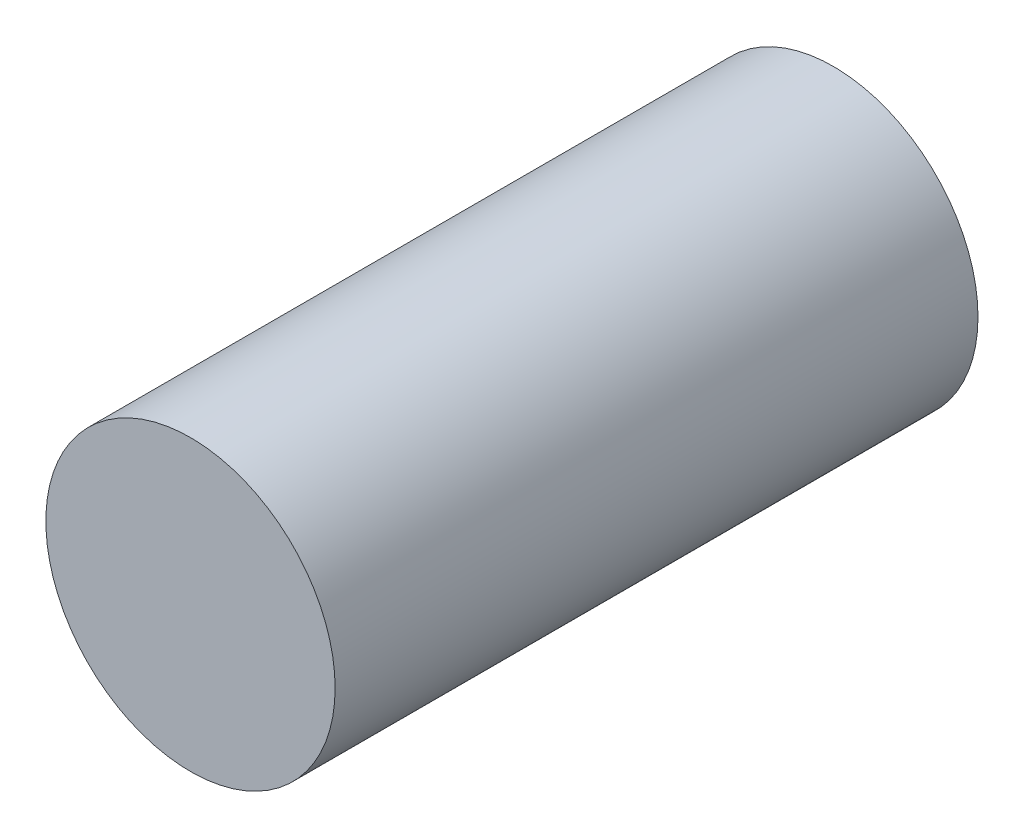
ISO-10303-21;
HEADER;
FILE_DESCRIPTION(('STEP AP214'),'2;1');
FILE_NAME('part.step','',(''),(''),'','','');
FILE_SCHEMA(('AUTOMOTIVE_DESIGN { 1 0 10303 214 1 1 1 1 }'));
ENDSEC;
DATA;
#1=APPLICATION_CONTEXT('core data for automotive mechanical design processes');
#2=APPLICATION_PROTOCOL_DEFINITION('international standard','automotive_design',2000,#1);
#3=PRODUCT_CONTEXT('',#1,'mechanical');
#4=PRODUCT('Part','Part','',(#3));
#5=PRODUCT_RELATED_PRODUCT_CATEGORY('part','',(#4));
#6=PRODUCT_DEFINITION_FORMATION('','',#4);
#7=PRODUCT_DEFINITION_CONTEXT('part definition',#1,'design');
#8=PRODUCT_DEFINITION('design','',#6,#7);
#9=PRODUCT_DEFINITION_SHAPE('','',#8);
#10=(LENGTH_UNIT() NAMED_UNIT(*) SI_UNIT(.MILLI.,.METRE.));
#11=(NAMED_UNIT(*) PLANE_ANGLE_UNIT() SI_UNIT($,.RADIAN.));
#12=(NAMED_UNIT(*) SI_UNIT($,.STERADIAN.) SOLID_ANGLE_UNIT());
#13=UNCERTAINTY_MEASURE_WITH_UNIT(LENGTH_MEASURE(1.E-05),#10,'distance_accuracy_value','');
#14=(GEOMETRIC_REPRESENTATION_CONTEXT(3) GLOBAL_UNCERTAINTY_ASSIGNED_CONTEXT((#13)) GLOBAL_UNIT_ASSIGNED_CONTEXT((#10,
#11,#12)) REPRESENTATION_CONTEXT('',''));
#15=CARTESIAN_POINT('',(0.,0.,0.));
#16=DIRECTION('',(0.,0.,1.));
#17=DIRECTION('',(1.,0.,0.));
#18=AXIS2_PLACEMENT_3D('',#15,#16,#17);
#19=CARTESIAN_POINT('',(0.,43.13837706885,-6.));
#20=DIRECTION('',(0.,0.,1.));
#21=DIRECTION('',(1.,0.,0.));
#22=AXIS2_PLACEMENT_3D('',#19,#20,#21);
#23=CYLINDRICAL_SURFACE('',#22,4.5);
#24=CARTESIAN_POINT('',(0.,43.13837706885,-6.));
#25=DIRECTION('',(0.,0.,1.));
#26=DIRECTION('',(1.,0.,0.));
#27=AXIS2_PLACEMENT_3D('',#24,#25,#26);
#28=CIRCLE('',#27,4.5);
#29=CARTESIAN_POINT('',(4.49999999999996,43.13837706885,-6.));
#30=VERTEX_POINT('',#29);
#31=EDGE_CURVE('E10',#30,#30,#28,.T.);
#32=ORIENTED_EDGE('',*,*,#31,.T.);
#33=EDGE_LOOP('',(#32));
#34=FACE_BOUND('',#33,.T.);
#35=CARTESIAN_POINT('',(0.,43.13837706885,14.));
#36=DIRECTION('',(0.,0.,1.));
#37=DIRECTION('',(1.,0.,0.));
#38=AXIS2_PLACEMENT_3D('',#35,#36,#37);
#39=CIRCLE('',#38,4.5);
#40=CARTESIAN_POINT('',(4.49999999999996,43.13837706885,14.));
#41=VERTEX_POINT('',#40);
#42=EDGE_CURVE('E41',#41,#41,#39,.T.);
#43=ORIENTED_EDGE('',*,*,#42,.F.);
#44=EDGE_LOOP('',(#43));
#45=FACE_BOUND('',#44,.T.);
#46=ADVANCED_FACE('F35',(#34,#45),#23,.T.);
#47=CARTESIAN_POINT('',(0.,43.13837706885,-6.));
#48=DIRECTION('',(0.,0.,1.));
#49=DIRECTION('',(1.,0.,0.));
#50=AXIS2_PLACEMENT_3D('',#47,#48,#49);
#51=PLANE('',#50);
#52=ORIENTED_EDGE('',*,*,#31,.F.);
#53=EDGE_LOOP('',(#52));
#54=FACE_BOUND('',#53,.T.);
#55=ADVANCED_FACE('F50',(#54),#51,.F.);
#56=CARTESIAN_POINT('',(0.,43.13837706885,14.));
#57=DIRECTION('',(0.,0.,1.));
#58=DIRECTION('',(1.,0.,0.));
#59=AXIS2_PLACEMENT_3D('',#56,#57,#58);
#60=PLANE('',#59);
#61=ORIENTED_EDGE('',*,*,#42,.T.);
#62=EDGE_LOOP('',(#61));
#63=FACE_BOUND('',#62,.T.);
#64=ADVANCED_FACE('F47',(#63),#60,.T.);
#65=CLOSED_SHELL('',(#46,#55,#64));
#66=MANIFOLD_SOLID_BREP('B2',#65);
#67=ADVANCED_BREP_SHAPE_REPRESENTATION('',(#18,#66),#14);
#68=SHAPE_DEFINITION_REPRESENTATION(#9,#67);
ENDSEC;
END-ISO-10303-21;
